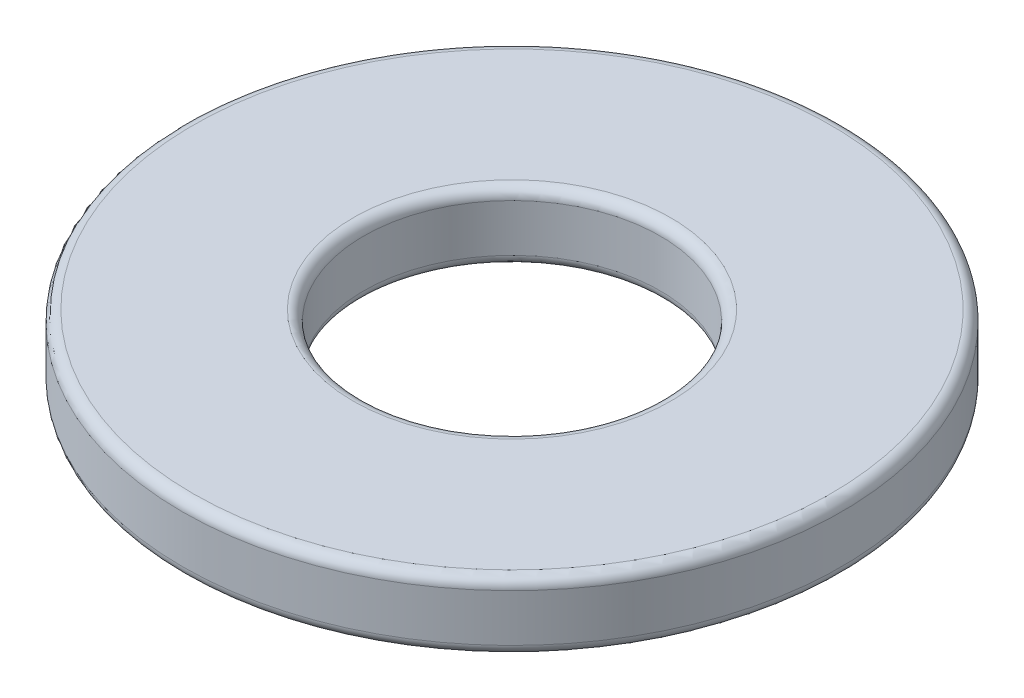
ISO-10303-21;
HEADER;
FILE_DESCRIPTION(('STEP AP214'),'2;1');
FILE_NAME('part.step','',(''),(''),'','','');
FILE_SCHEMA(('AUTOMOTIVE_DESIGN { 1 0 10303 214 1 1 1 1 }'));
ENDSEC;
DATA;
#1=APPLICATION_CONTEXT('core data for automotive mechanical design processes');
#2=APPLICATION_PROTOCOL_DEFINITION('international standard','automotive_design',2000,#1);
#3=PRODUCT_CONTEXT('',#1,'mechanical');
#4=PRODUCT('Part','Part','',(#3));
#5=PRODUCT_RELATED_PRODUCT_CATEGORY('part','',(#4));
#6=PRODUCT_DEFINITION_FORMATION('','',#4);
#7=PRODUCT_DEFINITION_CONTEXT('part definition',#1,'design');
#8=PRODUCT_DEFINITION('design','',#6,#7);
#9=PRODUCT_DEFINITION_SHAPE('','',#8);
#10=(LENGTH_UNIT() NAMED_UNIT(*) SI_UNIT(.MILLI.,.METRE.));
#11=(NAMED_UNIT(*) PLANE_ANGLE_UNIT() SI_UNIT($,.RADIAN.));
#12=(NAMED_UNIT(*) SI_UNIT($,.STERADIAN.) SOLID_ANGLE_UNIT());
#13=UNCERTAINTY_MEASURE_WITH_UNIT(LENGTH_MEASURE(1.E-05),#10,'distance_accuracy_value','');
#14=(GEOMETRIC_REPRESENTATION_CONTEXT(3) GLOBAL_UNCERTAINTY_ASSIGNED_CONTEXT((#13)) GLOBAL_UNIT_ASSIGNED_CONTEXT((#10,
#11,#12)) REPRESENTATION_CONTEXT('',''));
#15=CARTESIAN_POINT('',(0.,0.,0.));
#16=DIRECTION('',(0.,0.,1.));
#17=DIRECTION('',(1.,0.,0.));
#18=AXIS2_PLACEMENT_3D('',#15,#16,#17);
#19=CARTESIAN_POINT('',(0.,1.651,0.));
#20=DIRECTION('',(0.,1.,0.));
#21=DIRECTION('',(0.,0.,1.));
#22=AXIS2_PLACEMENT_3D('',#19,#20,#21);
#23=PLANE('',#22);
#24=CARTESIAN_POINT('',(0.,1.651,0.));
#25=DIRECTION('',(0.,1.,0.));
#26=DIRECTION('',(0.,0.,1.));
#27=AXIS2_PLACEMENT_3D('',#24,#25,#26);
#28=CIRCLE('',#27,3.825875);
#29=CARTESIAN_POINT('',(0.,1.651,3.825875));
#30=VERTEX_POINT('',#29);
#31=EDGE_CURVE('E10',#30,#30,#28,.F.);
#32=ORIENTED_EDGE('',*,*,#31,.T.);
#33=EDGE_LOOP('',(#32));
#34=FACE_BOUND('',#33,.T.);
#35=CARTESIAN_POINT('',(0.,1.651,0.));
#36=DIRECTION('',(0.,1.,0.));
#37=DIRECTION('',(0.,0.,1.));
#38=AXIS2_PLACEMENT_3D('',#35,#36,#37);
#39=CIRCLE('',#38,7.6835);
#40=CARTESIAN_POINT('',(0.,1.651,7.6835));
#41=VERTEX_POINT('',#40);
#42=EDGE_CURVE('E37',#41,#41,#39,.T.);
#43=ORIENTED_EDGE('',*,*,#42,.T.);
#44=EDGE_LOOP('',(#43));
#45=FACE_BOUND('',#44,.T.);
#46=ADVANCED_FACE('F30',(#34,#45),#23,.T.);
#47=CARTESIAN_POINT('',(0.,0.,0.));
#48=DIRECTION('',(0.,1.,0.));
#49=DIRECTION('',(0.,0.,1.));
#50=AXIS2_PLACEMENT_3D('',#47,#48,#49);
#51=PLANE('',#50);
#52=CARTESIAN_POINT('',(0.,0.,0.));
#53=DIRECTION('',(0.,1.,0.));
#54=DIRECTION('',(0.,0.,1.));
#55=AXIS2_PLACEMENT_3D('',#52,#53,#54);
#56=CIRCLE('',#55,3.825875);
#57=CARTESIAN_POINT('',(0.,0.,3.825875));
#58=VERTEX_POINT('',#57);
#59=EDGE_CURVE('E56',#58,#58,#56,.T.);
#60=ORIENTED_EDGE('',*,*,#59,.T.);
#61=EDGE_LOOP('',(#60));
#62=FACE_BOUND('',#61,.T.);
#63=CARTESIAN_POINT('',(0.,0.,0.));
#64=DIRECTION('',(0.,1.,0.));
#65=DIRECTION('',(0.,0.,1.));
#66=AXIS2_PLACEMENT_3D('',#63,#64,#65);
#67=CIRCLE('',#66,7.6835);
#68=CARTESIAN_POINT('',(0.,0.,7.6835));
#69=VERTEX_POINT('',#68);
#70=EDGE_CURVE('E59',#69,#69,#67,.F.);
#71=ORIENTED_EDGE('',*,*,#70,.T.);
#72=EDGE_LOOP('',(#71));
#73=FACE_BOUND('',#72,.T.);
#74=ADVANCED_FACE('F63',(#62,#73),#51,.F.);
#75=CARTESIAN_POINT('',(0.,1.651,0.));
#76=DIRECTION('',(0.,-1.,0.));
#77=DIRECTION('',(0.,0.,-1.));
#78=AXIS2_PLACEMENT_3D('',#75,#76,#77);
#79=CYLINDRICAL_SURFACE('',#78,7.9375);
#80=CARTESIAN_POINT('',(0.,0.254,0.));
#81=DIRECTION('',(0.,1.,0.));
#82=DIRECTION('',(0.,0.,1.));
#83=AXIS2_PLACEMENT_3D('',#80,#81,#82);
#84=CIRCLE('',#83,7.9375);
#85=CARTESIAN_POINT('',(0.,0.254,7.9375));
#86=VERTEX_POINT('',#85);
#87=EDGE_CURVE('E41',#86,#86,#84,.T.);
#88=ORIENTED_EDGE('',*,*,#87,.T.);
#89=EDGE_LOOP('',(#88));
#90=FACE_BOUND('',#89,.T.);
#91=CARTESIAN_POINT('',(0.,1.397,0.));
#92=DIRECTION('',(0.,1.,0.));
#93=DIRECTION('',(0.,0.,1.));
#94=AXIS2_PLACEMENT_3D('',#91,#92,#93);
#95=CIRCLE('',#94,7.9375);
#96=CARTESIAN_POINT('',(0.,1.397,7.9375));
#97=VERTEX_POINT('',#96);
#98=EDGE_CURVE('E45',#97,#97,#95,.F.);
#99=ORIENTED_EDGE('',*,*,#98,.T.);
#100=EDGE_LOOP('',(#99));
#101=FACE_BOUND('',#100,.T.);
#102=ADVANCED_FACE('F73',(#90,#101),#79,.T.);
#103=CARTESIAN_POINT('',(0.,1.651,0.));
#104=DIRECTION('',(0.,-1.,0.));
#105=DIRECTION('',(0.,0.,-1.));
#106=AXIS2_PLACEMENT_3D('',#103,#104,#105);
#107=CYLINDRICAL_SURFACE('',#106,3.571875);
#108=CARTESIAN_POINT('',(0.,0.254,0.));
#109=DIRECTION('',(0.,1.,0.));
#110=DIRECTION('',(0.,0.,1.));
#111=AXIS2_PLACEMENT_3D('',#108,#109,#110);
#112=CIRCLE('',#111,3.571875);
#113=CARTESIAN_POINT('',(0.,0.254,3.571875));
#114=VERTEX_POINT('',#113);
#115=EDGE_CURVE('E50',#114,#114,#112,.F.);
#116=ORIENTED_EDGE('',*,*,#115,.T.);
#117=EDGE_LOOP('',(#116));
#118=FACE_BOUND('',#117,.T.);
#119=CARTESIAN_POINT('',(0.,1.397,0.));
#120=DIRECTION('',(0.,1.,0.));
#121=DIRECTION('',(0.,0.,1.));
#122=AXIS2_PLACEMENT_3D('',#119,#120,#121);
#123=CIRCLE('',#122,3.571875);
#124=CARTESIAN_POINT('',(0.,1.397,3.571875));
#125=VERTEX_POINT('',#124);
#126=EDGE_CURVE('E53',#125,#125,#123,.T.);
#127=ORIENTED_EDGE('',*,*,#126,.T.);
#128=EDGE_LOOP('',(#127));
#129=FACE_BOUND('',#128,.T.);
#130=ADVANCED_FACE('F76',(#118,#129),#107,.F.);
#131=CARTESIAN_POINT('',(0.,0.254,0.));
#132=DIRECTION('',(0.,1.,0.));
#133=DIRECTION('',(0.,0.,1.));
#134=AXIS2_PLACEMENT_3D('',#131,#132,#133);
#135=TOROIDAL_SURFACE('',#134,3.825875,0.254);
#136=ORIENTED_EDGE('',*,*,#115,.F.);
#137=EDGE_LOOP('',(#136));
#138=FACE_BOUND('',#137,.T.);
#139=ORIENTED_EDGE('',*,*,#59,.F.);
#140=EDGE_LOOP('',(#139));
#141=FACE_BOUND('',#140,.T.);
#142=ADVANCED_FACE('F69',(#138,#141),#135,.T.);
#143=CARTESIAN_POINT('',(0.,0.254,0.));
#144=DIRECTION('',(0.,1.,0.));
#145=DIRECTION('',(0.,0.,1.));
#146=AXIS2_PLACEMENT_3D('',#143,#144,#145);
#147=TOROIDAL_SURFACE('',#146,7.6835,0.254);
#148=ORIENTED_EDGE('',*,*,#70,.F.);
#149=EDGE_LOOP('',(#148));
#150=FACE_BOUND('',#149,.T.);
#151=ORIENTED_EDGE('',*,*,#87,.F.);
#152=EDGE_LOOP('',(#151));
#153=FACE_BOUND('',#152,.T.);
#154=ADVANCED_FACE('F65',(#150,#153),#147,.T.);
#155=CARTESIAN_POINT('',(0.,1.397,0.));
#156=DIRECTION('',(0.,1.,0.));
#157=DIRECTION('',(0.,0.,1.));
#158=AXIS2_PLACEMENT_3D('',#155,#156,#157);
#159=TOROIDAL_SURFACE('',#158,3.825875,0.254);
#160=ORIENTED_EDGE('',*,*,#31,.F.);
#161=EDGE_LOOP('',(#160));
#162=FACE_BOUND('',#161,.T.);
#163=ORIENTED_EDGE('',*,*,#126,.F.);
#164=EDGE_LOOP('',(#163));
#165=FACE_BOUND('',#164,.T.);
#166=ADVANCED_FACE('F68',(#162,#165),#159,.T.);
#167=CARTESIAN_POINT('',(0.,1.397,0.));
#168=DIRECTION('',(0.,1.,0.));
#169=DIRECTION('',(0.,0.,1.));
#170=AXIS2_PLACEMENT_3D('',#167,#168,#169);
#171=TOROIDAL_SURFACE('',#170,7.6835,0.254);
#172=ORIENTED_EDGE('',*,*,#98,.F.);
#173=EDGE_LOOP('',(#172));
#174=FACE_BOUND('',#173,.T.);
#175=ORIENTED_EDGE('',*,*,#42,.F.);
#176=EDGE_LOOP('',(#175));
#177=FACE_BOUND('',#176,.T.);
#178=ADVANCED_FACE('F32',(#174,#177),#171,.T.);
#179=CLOSED_SHELL('',(#46,#74,#102,#130,#142,#154,#166,#178));
#180=MANIFOLD_SOLID_BREP('B2',#179);
#181=ADVANCED_BREP_SHAPE_REPRESENTATION('',(#18,#180),#14);
#182=SHAPE_DEFINITION_REPRESENTATION(#9,#181);
ENDSEC;
END-ISO-10303-21;
